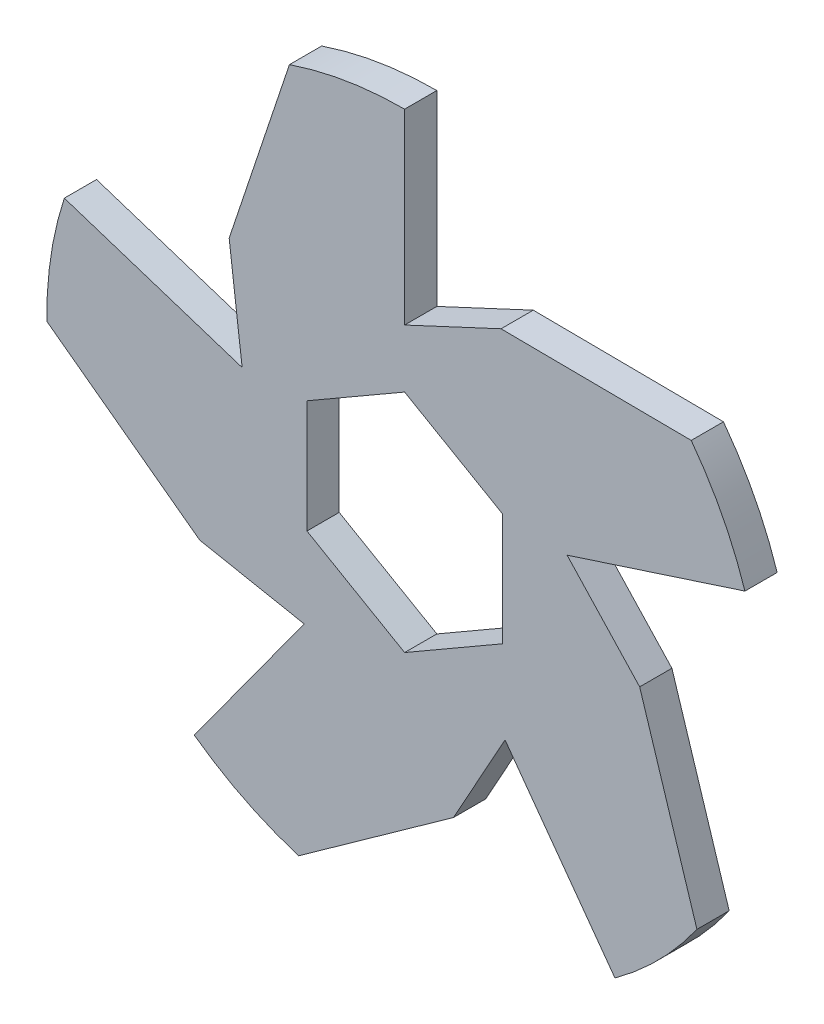
ISO-10303-21;
HEADER;
FILE_DESCRIPTION(('STEP AP214'),'2;1');
FILE_NAME('part.step','',(''),(''),'','','');
FILE_SCHEMA(('AUTOMOTIVE_DESIGN { 1 0 10303 214 1 1 1 1 }'));
ENDSEC;
DATA;
#1=APPLICATION_CONTEXT('core data for automotive mechanical design processes');
#2=APPLICATION_PROTOCOL_DEFINITION('international standard','automotive_design',2000,#1);
#3=PRODUCT_CONTEXT('',#1,'mechanical');
#4=PRODUCT('Part','Part','',(#3));
#5=PRODUCT_RELATED_PRODUCT_CATEGORY('part','',(#4));
#6=PRODUCT_DEFINITION_FORMATION('','',#4);
#7=PRODUCT_DEFINITION_CONTEXT('part definition',#1,'design');
#8=PRODUCT_DEFINITION('design','',#6,#7);
#9=PRODUCT_DEFINITION_SHAPE('','',#8);
#10=(LENGTH_UNIT() NAMED_UNIT(*) SI_UNIT(.MILLI.,.METRE.));
#11=(NAMED_UNIT(*) PLANE_ANGLE_UNIT() SI_UNIT($,.RADIAN.));
#12=(NAMED_UNIT(*) SI_UNIT($,.STERADIAN.) SOLID_ANGLE_UNIT());
#13=UNCERTAINTY_MEASURE_WITH_UNIT(LENGTH_MEASURE(1.E-05),#10,'distance_accuracy_value','');
#14=(GEOMETRIC_REPRESENTATION_CONTEXT(3) GLOBAL_UNCERTAINTY_ASSIGNED_CONTEXT((#13)) GLOBAL_UNIT_ASSIGNED_CONTEXT((#10,
#11,#12)) REPRESENTATION_CONTEXT('',''));
#15=CARTESIAN_POINT('',(0.,0.,0.));
#16=DIRECTION('',(0.,0.,1.));
#17=DIRECTION('',(1.,0.,0.));
#18=AXIS2_PLACEMENT_3D('',#15,#16,#17);
#19=CARTESIAN_POINT('',(0.,0.,5.));
#20=DIRECTION('',(0.309016994374945,-0.951056516295155,0.));
#21=DIRECTION('',(0.951056516295155,0.309016994374945,0.));
#22=AXIS2_PLACEMENT_3D('',#19,#20,#21);
#23=PLANE('',#22);
#24=DIRECTION('',(-0.951056516295154,-0.309016994374945,0.));
#25=VECTOR('',#24,1.);
#26=CARTESIAN_POINT('',(0.,0.,0.));
#27=LINE('',#26,#25);
#28=CARTESIAN_POINT('',(52.7836366543811,17.1504431878094,0.));
#29=VERTEX_POINT('',#28);
#30=CARTESIAN_POINT('',(25.2029976818216,8.18895035093603,0.));
#31=VERTEX_POINT('',#30);
#32=EDGE_CURVE('E264',#29,#31,#27,.T.);
#33=ORIENTED_EDGE('',*,*,#32,.F.);
#34=DIRECTION('',(0.,0.,-1.));
#35=VECTOR('',#34,1.);
#36=CARTESIAN_POINT('',(52.7836366543811,17.1504431878094,5.));
#37=LINE('',#36,#35);
#38=CARTESIAN_POINT('',(52.7836366543811,17.1504431878094,5.));
#39=VERTEX_POINT('',#38);
#40=EDGE_CURVE('E11',#39,#29,#37,.T.);
#41=ORIENTED_EDGE('',*,*,#40,.F.);
#42=DIRECTION('',(-0.951056516295154,-0.309016994374945,0.));
#43=VECTOR('',#42,1.);
#44=CARTESIAN_POINT('',(0.,0.,5.));
#45=LINE('',#44,#43);
#46=CARTESIAN_POINT('',(25.2029976818216,8.18895035093603,5.));
#47=VERTEX_POINT('',#46);
#48=EDGE_CURVE('E387',#39,#47,#45,.T.);
#49=ORIENTED_EDGE('',*,*,#48,.T.);
#50=DIRECTION('',(0.,0.,-1.));
#51=VECTOR('',#50,1.);
#52=CARTESIAN_POINT('',(25.2029976818216,8.18895035093603,5.));
#53=LINE('',#52,#51);
#54=EDGE_CURVE('E53',#47,#31,#53,.T.);
#55=ORIENTED_EDGE('',*,*,#54,.T.);
#56=EDGE_LOOP('',(#33,#41,#49,#55));
#57=FACE_BOUND('',#56,.T.);
#58=ADVANCED_FACE('F34',(#57),#23,.T.);
#59=CARTESIAN_POINT('',(0.,0.,5.));
#60=DIRECTION('',(0.,0.,-1.));
#61=DIRECTION('',(-1.,0.,0.));
#62=AXIS2_PLACEMENT_3D('',#59,#60,#61);
#63=CYLINDRICAL_SURFACE('',#62,55.5);
#64=CARTESIAN_POINT('',(0.,0.,0.));
#65=DIRECTION('',(0.,0.,1.));
#66=DIRECTION('',(1.,0.,0.));
#67=AXIS2_PLACEMENT_3D('',#64,#65,#66);
#68=CIRCLE('',#67,55.5);
#69=CARTESIAN_POINT('',(44.453068744138,33.2291239612021,0.));
#70=VERTEX_POINT('',#69);
#71=EDGE_CURVE('E266',#29,#70,#68,.T.);
#72=ORIENTED_EDGE('',*,*,#71,.T.);
#73=DIRECTION('',(0.,0.,-1.));
#74=VECTOR('',#73,1.);
#75=CARTESIAN_POINT('',(44.453068744138,33.2291239612021,5.));
#76=LINE('',#75,#74);
#77=CARTESIAN_POINT('',(44.453068744138,33.2291239612021,5.));
#78=VERTEX_POINT('',#77);
#79=EDGE_CURVE('E44',#78,#70,#76,.T.);
#80=ORIENTED_EDGE('',*,*,#79,.F.);
#81=CARTESIAN_POINT('',(0.,0.,5.));
#82=DIRECTION('',(0.,0.,1.));
#83=DIRECTION('',(1.,0.,0.));
#84=AXIS2_PLACEMENT_3D('',#81,#82,#83);
#85=CIRCLE('',#84,55.5);
#86=EDGE_CURVE('E228',#39,#78,#85,.T.);
#87=ORIENTED_EDGE('',*,*,#86,.F.);
#88=ORIENTED_EDGE('',*,*,#40,.T.);
#89=EDGE_LOOP('',(#72,#80,#87,#88));
#90=FACE_BOUND('',#89,.T.);
#91=ADVANCED_FACE('F485',(#90),#63,.T.);
#92=CARTESIAN_POINT('',(0.277965080714487,33.5946328303534,5.));
#93=DIRECTION('',(0.00827380872947419,0.999965771458758,0.));
#94=DIRECTION('',(-0.999965771458758,0.00827380872947419,0.));
#95=AXIS2_PLACEMENT_3D('',#92,#93,#94);
#96=PLANE('',#95);
#97=DIRECTION('',(0.999965771458758,-0.00827380872947419,0.));
#98=VECTOR('',#97,1.);
#99=CARTESIAN_POINT('',(0.277965080714487,33.5946328303534,0.));
#100=LINE('',#99,#98);
#101=CARTESIAN_POINT('',(14.9540784861047,33.4732013187216,0.));
#102=VERTEX_POINT('',#101);
#103=EDGE_CURVE('E269',#102,#70,#100,.T.);
#104=ORIENTED_EDGE('',*,*,#103,.F.);
#105=DIRECTION('',(0.,0.,-1.));
#106=VECTOR('',#105,1.);
#107=CARTESIAN_POINT('',(14.9540784861047,33.4732013187216,5.));
#108=LINE('',#107,#106);
#109=CARTESIAN_POINT('',(14.9540784861047,33.4732013187216,5.));
#110=VERTEX_POINT('',#109);
#111=EDGE_CURVE('E343',#110,#102,#108,.T.);
#112=ORIENTED_EDGE('',*,*,#111,.F.);
#113=DIRECTION('',(0.999965771458758,-0.00827380872947419,0.));
#114=VECTOR('',#113,1.);
#115=CARTESIAN_POINT('',(0.277965080714487,33.5946328303534,5.));
#116=LINE('',#115,#114);
#117=EDGE_CURVE('E389',#110,#78,#116,.T.);
#118=ORIENTED_EDGE('',*,*,#117,.T.);
#119=ORIENTED_EDGE('',*,*,#79,.T.);
#120=EDGE_LOOP('',(#104,#112,#118,#119));
#121=FACE_BOUND('',#120,.T.);
#122=ADVANCED_FACE('F490',(#121),#96,.T.);
#123=CARTESIAN_POINT('',(-10.1500888713265,21.7669358283465,5.));
#124=DIRECTION('',(-0.422618261740704,0.906307787036648,0.));
#125=DIRECTION('',(-0.906307787036648,-0.422618261740704,0.));
#126=AXIS2_PLACEMENT_3D('',#123,#124,#125);
#127=PLANE('',#126);
#128=DIRECTION('',(0.906307787036648,0.422618261740704,0.));
#129=VECTOR('',#128,1.);
#130=CARTESIAN_POINT('',(-10.1500888713265,21.7669358283465,0.));
#131=LINE('',#130,#129);
#132=CARTESIAN_POINT('',(0.,26.5,0.));
#133=VERTEX_POINT('',#132);
#134=EDGE_CURVE('E273',#133,#102,#131,.T.);
#135=ORIENTED_EDGE('',*,*,#134,.F.);
#136=DIRECTION('',(0.,0.,-1.));
#137=VECTOR('',#136,1.);
#138=CARTESIAN_POINT('',(0.,26.5,5.));
#139=LINE('',#138,#137);
#140=CARTESIAN_POINT('',(0.,26.5,5.));
#141=VERTEX_POINT('',#140);
#142=EDGE_CURVE('E341',#141,#133,#139,.T.);
#143=ORIENTED_EDGE('',*,*,#142,.F.);
#144=DIRECTION('',(0.906307787036648,0.422618261740704,0.));
#145=VECTOR('',#144,1.);
#146=CARTESIAN_POINT('',(-10.1500888713265,21.7669358283465,5.));
#147=LINE('',#146,#145);
#148=EDGE_CURVE('E393',#141,#110,#147,.T.);
#149=ORIENTED_EDGE('',*,*,#148,.T.);
#150=ORIENTED_EDGE('',*,*,#111,.T.);
#151=EDGE_LOOP('',(#135,#143,#149,#150));
#152=FACE_BOUND('',#151,.T.);
#153=ADVANCED_FACE('F682',(#152),#127,.T.);
#154=CARTESIAN_POINT('',(0.,0.,5.));
#155=DIRECTION('',(1.,0.,0.));
#156=DIRECTION('',(0.,1.,0.));
#157=AXIS2_PLACEMENT_3D('',#154,#155,#156);
#158=PLANE('',#157);
#159=DIRECTION('',(0.,-1.,0.));
#160=VECTOR('',#159,1.);
#161=CARTESIAN_POINT('',(0.,0.,0.));
#162=LINE('',#161,#160);
#163=CARTESIAN_POINT('',(0.,55.5,0.));
#164=VERTEX_POINT('',#163);
#165=EDGE_CURVE('E276',#164,#133,#162,.T.);
#166=ORIENTED_EDGE('',*,*,#165,.F.);
#167=DIRECTION('',(0.,0.,-1.));
#168=VECTOR('',#167,1.);
#169=CARTESIAN_POINT('',(0.,55.5,5.));
#170=LINE('',#169,#168);
#171=CARTESIAN_POINT('',(0.,55.5,5.));
#172=VERTEX_POINT('',#171);
#173=EDGE_CURVE('E339',#172,#164,#170,.T.);
#174=ORIENTED_EDGE('',*,*,#173,.F.);
#175=DIRECTION('',(0.,-1.,0.));
#176=VECTOR('',#175,1.);
#177=CARTESIAN_POINT('',(0.,0.,5.));
#178=LINE('',#177,#176);
#179=EDGE_CURVE('E396',#172,#141,#178,.T.);
#180=ORIENTED_EDGE('',*,*,#179,.T.);
#181=ORIENTED_EDGE('',*,*,#142,.T.);
#182=EDGE_LOOP('',(#166,#174,#180,#181));
#183=FACE_BOUND('',#182,.T.);
#184=ADVANCED_FACE('F673',(#183),#158,.T.);
#185=CARTESIAN_POINT('',(-17.8660211800237,52.5457447106323,0.));
#186=VERTEX_POINT('',#185);
#187=EDGE_CURVE('E270',#164,#186,#68,.T.);
#188=ORIENTED_EDGE('',*,*,#187,.T.);
#189=DIRECTION('',(0.,0.,-1.));
#190=VECTOR('',#189,1.);
#191=CARTESIAN_POINT('',(-17.8660211800237,52.5457447106323,5.));
#192=LINE('',#191,#190);
#193=CARTESIAN_POINT('',(-17.8660211800237,52.5457447106323,5.));
#194=VERTEX_POINT('',#193);
#195=EDGE_CURVE('E337',#194,#186,#192,.T.);
#196=ORIENTED_EDGE('',*,*,#195,.F.);
#197=EDGE_CURVE('E390',#172,#194,#85,.T.);
#198=ORIENTED_EDGE('',*,*,#197,.F.);
#199=ORIENTED_EDGE('',*,*,#173,.T.);
#200=EDGE_LOOP('',(#188,#196,#198,#199));
#201=FACE_BOUND('',#200,.T.);
#202=ADVANCED_FACE('F439',(#201),#63,.T.);
#203=CARTESIAN_POINT('',(-31.864498532067,10.6456729656821,5.));
#204=DIRECTION('',(-0.948467215512343,0.316875276880768,0.));
#205=DIRECTION('',(-0.316875276880768,-0.948467215512343,0.));
#206=AXIS2_PLACEMENT_3D('',#203,#204,#205);
#207=PLANE('',#206);
#208=DIRECTION('',(0.316875276880768,0.948467215512343,0.));
#209=VECTOR('',#208,1.);
#210=CARTESIAN_POINT('',(-31.864498532067,10.6456729656821,0.));
#211=LINE('',#210,#209);
#212=CARTESIAN_POINT('',(-27.2138418480063,24.5659618530182,0.));
#213=VERTEX_POINT('',#212);
#214=EDGE_CURVE('E279',#213,#186,#211,.T.);
#215=ORIENTED_EDGE('',*,*,#214,.F.);
#216=DIRECTION('',(0.,0.,-1.));
#217=VECTOR('',#216,1.);
#218=CARTESIAN_POINT('',(-27.2138418480063,24.5659618530182,5.));
#219=LINE('',#218,#217);
#220=CARTESIAN_POINT('',(-27.2138418480063,24.5659618530182,5.));
#221=VERTEX_POINT('',#220);
#222=EDGE_CURVE('E335',#221,#213,#219,.T.);
#223=ORIENTED_EDGE('',*,*,#222,.F.);
#224=DIRECTION('',(0.316875276880768,0.948467215512343,0.));
#225=VECTOR('',#224,1.);
#226=CARTESIAN_POINT('',(-31.864498532067,10.6456729656821,5.));
#227=LINE('',#226,#225);
#228=EDGE_CURVE('E399',#221,#194,#227,.T.);
#229=ORIENTED_EDGE('',*,*,#228,.T.);
#230=ORIENTED_EDGE('',*,*,#195,.T.);
#231=EDGE_LOOP('',(#215,#223,#229,#230));
#232=FACE_BOUND('',#231,.T.);
#233=ADVANCED_FACE('F445',(#232),#207,.T.);
#234=CARTESIAN_POINT('',(-23.8381361149834,-2.92695507562176,5.));
#235=DIRECTION('',(-0.992546151641323,-0.121869343405142,0.));
#236=DIRECTION('',(0.121869343405142,-0.992546151641323,0.));
#237=AXIS2_PLACEMENT_3D('',#234,#235,#236);
#238=PLANE('',#237);
#239=DIRECTION('',(-0.121869343405142,0.992546151641323,0.));
#240=VECTOR('',#239,1.);
#241=CARTESIAN_POINT('',(-23.8381361149834,-2.92695507562176,0.));
#242=LINE('',#241,#240);
#243=CARTESIAN_POINT('',(-25.2029976818215,8.1889503509364,0.));
#244=VERTEX_POINT('',#243);
#245=EDGE_CURVE('E282',#244,#213,#242,.T.);
#246=ORIENTED_EDGE('',*,*,#245,.F.);
#247=DIRECTION('',(0.,0.,-1.));
#248=VECTOR('',#247,1.);
#249=CARTESIAN_POINT('',(-25.2029976818215,8.1889503509364,5.));
#250=LINE('',#249,#248);
#251=CARTESIAN_POINT('',(-25.2029976818215,8.1889503509364,5.));
#252=VERTEX_POINT('',#251);
#253=EDGE_CURVE('E333',#252,#244,#250,.T.);
#254=ORIENTED_EDGE('',*,*,#253,.F.);
#255=DIRECTION('',(-0.121869343405142,0.992546151641323,0.));
#256=VECTOR('',#255,1.);
#257=CARTESIAN_POINT('',(-23.8381361149834,-2.92695507562176,5.));
#258=LINE('',#257,#256);
#259=EDGE_CURVE('E402',#252,#221,#258,.T.);
#260=ORIENTED_EDGE('',*,*,#259,.T.);
#261=ORIENTED_EDGE('',*,*,#222,.T.);
#262=EDGE_LOOP('',(#246,#254,#260,#261));
#263=FACE_BOUND('',#262,.T.);
#264=ADVANCED_FACE('F451',(#263),#238,.T.);
#265=CARTESIAN_POINT('',(0.,0.,5.));
#266=DIRECTION('',(0.309016994374958,0.95105651629515,0.));
#267=DIRECTION('',(-0.95105651629515,0.309016994374958,0.));
#268=AXIS2_PLACEMENT_3D('',#265,#266,#267);
#269=PLANE('',#268);
#270=DIRECTION('',(0.95105651629515,-0.309016994374958,0.));
#271=VECTOR('',#270,1.);
#272=CARTESIAN_POINT('',(0.,0.,0.));
#273=LINE('',#272,#271);
#274=CARTESIAN_POINT('',(-52.7836366543808,17.1504431878102,0.));
#275=VERTEX_POINT('',#274);
#276=EDGE_CURVE('E285',#275,#244,#273,.T.);
#277=ORIENTED_EDGE('',*,*,#276,.F.);
#278=DIRECTION('',(0.,0.,-1.));
#279=VECTOR('',#278,1.);
#280=CARTESIAN_POINT('',(-52.7836366543808,17.1504431878102,5.));
#281=LINE('',#280,#279);
#282=CARTESIAN_POINT('',(-52.7836366543808,17.1504431878102,5.));
#283=VERTEX_POINT('',#282);
#284=EDGE_CURVE('E331',#283,#275,#281,.T.);
#285=ORIENTED_EDGE('',*,*,#284,.F.);
#286=DIRECTION('',(0.95105651629515,-0.309016994374958,0.));
#287=VECTOR('',#286,1.);
#288=CARTESIAN_POINT('',(0.,0.,5.));
#289=LINE('',#288,#287);
#290=EDGE_CURVE('E405',#283,#252,#289,.T.);
#291=ORIENTED_EDGE('',*,*,#290,.T.);
#292=ORIENTED_EDGE('',*,*,#253,.T.);
#293=EDGE_LOOP('',(#277,#285,#291,#292));
#294=FACE_BOUND('',#293,.T.);
#295=ADVANCED_FACE('F454',(#294),#269,.T.);
#296=CARTESIAN_POINT('',(-55.4948770771185,-0.75406776585598,0.));
#297=VERTEX_POINT('',#296);
#298=EDGE_CURVE('E288',#275,#297,#68,.T.);
#299=ORIENTED_EDGE('',*,*,#298,.T.);
#300=DIRECTION('',(0.,0.,-1.));
#301=VECTOR('',#300,1.);
#302=CARTESIAN_POINT('',(-55.4948770771185,-0.75406776585598,5.));
#303=LINE('',#302,#301);
#304=CARTESIAN_POINT('',(-55.4948770771185,-0.75406776585598,5.));
#305=VERTEX_POINT('',#304);
#306=EDGE_CURVE('E329',#305,#297,#303,.T.);
#307=ORIENTED_EDGE('',*,*,#306,.F.);
#308=EDGE_CURVE('E408',#283,#305,#85,.T.);
#309=ORIENTED_EDGE('',*,*,#308,.F.);
#310=ORIENTED_EDGE('',*,*,#284,.T.);
#311=EDGE_LOOP('',(#299,#307,#309,#310));
#312=FACE_BOUND('',#311,.T.);
#313=ADVANCED_FACE('F458',(#312),#63,.T.);
#314=CARTESIAN_POINT('',(-19.9713082080033,-27.015245104446,5.));
#315=DIRECTION('',(-0.594458785131083,-0.804126080151911,0.));
#316=DIRECTION('',(0.804126080151911,-0.594458785131083,0.));
#317=AXIS2_PLACEMENT_3D('',#314,#315,#316);
#318=PLANE('',#317);
#319=DIRECTION('',(-0.804126080151911,0.594458785131083,0.));
#320=VECTOR('',#319,1.);
#321=CARTESIAN_POINT('',(-19.9713082080033,-27.015245104446,0.));
#322=LINE('',#321,#320);
#323=CARTESIAN_POINT('',(-31.7731577126372,-18.2906019272229,0.));
#324=VERTEX_POINT('',#323);
#325=EDGE_CURVE('E289',#324,#297,#322,.T.);
#326=ORIENTED_EDGE('',*,*,#325,.F.);
#327=DIRECTION('',(0.,0.,-1.));
#328=VECTOR('',#327,1.);
#329=CARTESIAN_POINT('',(-31.7731577126372,-18.2906019272229,5.));
#330=LINE('',#329,#328);
#331=CARTESIAN_POINT('',(-31.7731577126372,-18.2906019272229,5.));
#332=VERTEX_POINT('',#331);
#333=EDGE_CURVE('E327',#332,#324,#330,.T.);
#334=ORIENTED_EDGE('',*,*,#333,.F.);
#335=DIRECTION('',(-0.804126080151911,0.594458785131083,0.));
#336=VECTOR('',#335,1.);
#337=CARTESIAN_POINT('',(-19.9713082080033,-27.015245104446,5.));
#338=LINE('',#337,#336);
#339=EDGE_CURVE('E409',#332,#305,#338,.T.);
#340=ORIENTED_EDGE('',*,*,#339,.T.);
#341=ORIENTED_EDGE('',*,*,#306,.T.);
#342=EDGE_LOOP('',(#326,#334,#340,#341));
#343=FACE_BOUND('',#342,.T.);
#344=ADVANCED_FACE('F461',(#343),#318,.T.);
#345=CARTESIAN_POINT('',(-4.58268947617975,-23.5758935486249,5.));
#346=DIRECTION('',(-0.190808995376549,-0.981627183447663,0.));
#347=DIRECTION('',(0.981627183447663,-0.190808995376549,0.));
#348=AXIS2_PLACEMENT_3D('',#345,#346,#347);
#349=PLANE('',#348);
#350=DIRECTION('',(-0.981627183447663,0.190808995376549,0.));
#351=VECTOR('',#350,1.);
#352=CARTESIAN_POINT('',(-4.58268947617975,-23.5758935486249,0.));
#353=LINE('',#352,#351);
#354=CARTESIAN_POINT('',(-15.5763091857507,-21.438950350936,0.));
#355=VERTEX_POINT('',#354);
#356=EDGE_CURVE('E292',#355,#324,#353,.T.);
#357=ORIENTED_EDGE('',*,*,#356,.F.);
#358=DIRECTION('',(0.,0.,-1.));
#359=VECTOR('',#358,1.);
#360=CARTESIAN_POINT('',(-15.5763091857507,-21.438950350936,5.));
#361=LINE('',#360,#359);
#362=CARTESIAN_POINT('',(-15.5763091857507,-21.438950350936,5.));
#363=VERTEX_POINT('',#362);
#364=EDGE_CURVE('E325',#363,#355,#361,.T.);
#365=ORIENTED_EDGE('',*,*,#364,.F.);
#366=DIRECTION('',(-0.981627183447663,0.190808995376549,0.));
#367=VECTOR('',#366,1.);
#368=CARTESIAN_POINT('',(-4.58268947617975,-23.5758935486249,5.));
#369=LINE('',#368,#367);
#370=EDGE_CURVE('E412',#363,#332,#369,.T.);
#371=ORIENTED_EDGE('',*,*,#370,.T.);
#372=ORIENTED_EDGE('',*,*,#333,.T.);
#373=EDGE_LOOP('',(#357,#365,#371,#372));
#374=FACE_BOUND('',#373,.T.);
#375=ADVANCED_FACE('F464',(#374),#349,.T.);
#376=CARTESIAN_POINT('',(0.,0.,5.));
#377=DIRECTION('',(-0.809016994374942,0.58778525229248,0.));
#378=DIRECTION('',(-0.58778525229248,-0.809016994374942,0.));
#379=AXIS2_PLACEMENT_3D('',#376,#377,#378);
#380=PLANE('',#379);
#381=DIRECTION('',(0.58778525229248,0.809016994374942,0.));
#382=VECTOR('',#381,1.);
#383=CARTESIAN_POINT('',(0.,0.,0.));
#384=LINE('',#383,#382);
#385=CARTESIAN_POINT('',(-32.6220815022327,-44.9004431878093,0.));
#386=VERTEX_POINT('',#385);
#387=EDGE_CURVE('E295',#386,#355,#384,.T.);
#388=ORIENTED_EDGE('',*,*,#387,.F.);
#389=DIRECTION('',(0.,0.,-1.));
#390=VECTOR('',#389,1.);
#391=CARTESIAN_POINT('',(-32.6220815022327,-44.9004431878093,5.));
#392=LINE('',#391,#390);
#393=CARTESIAN_POINT('',(-32.6220815022327,-44.9004431878093,5.));
#394=VERTEX_POINT('',#393);
#395=EDGE_CURVE('E323',#394,#386,#392,.T.);
#396=ORIENTED_EDGE('',*,*,#395,.F.);
#397=DIRECTION('',(0.58778525229248,0.809016994374942,0.));
#398=VECTOR('',#397,1.);
#399=CARTESIAN_POINT('',(0.,0.,5.));
#400=LINE('',#399,#398);
#401=EDGE_CURVE('E415',#394,#363,#400,.T.);
#402=ORIENTED_EDGE('',*,*,#401,.T.);
#403=ORIENTED_EDGE('',*,*,#364,.T.);
#404=EDGE_LOOP('',(#388,#396,#402,#403));
#405=FACE_BOUND('',#404,.T.);
#406=ADVANCED_FACE('F468',(#405),#380,.T.);
#407=CARTESIAN_POINT('',(-16.4316990551327,-53.011784219752,0.));
#408=VERTEX_POINT('',#407);
#409=EDGE_CURVE('E298',#386,#408,#68,.T.);
#410=ORIENTED_EDGE('',*,*,#409,.T.);
#411=DIRECTION('',(0.,0.,-1.));
#412=VECTOR('',#411,1.);
#413=CARTESIAN_POINT('',(-16.4316990551327,-53.011784219752,5.));
#414=LINE('',#413,#412);
#415=CARTESIAN_POINT('',(-16.4316990551327,-53.011784219752,5.));
#416=VERTEX_POINT('',#415);
#417=EDGE_CURVE('E321',#416,#408,#414,.T.);
#418=ORIENTED_EDGE('',*,*,#417,.F.);
#419=EDGE_CURVE('E227',#394,#416,#85,.T.);
#420=ORIENTED_EDGE('',*,*,#419,.F.);
#421=ORIENTED_EDGE('',*,*,#395,.T.);
#422=EDGE_LOOP('',(#410,#418,#420,#421));
#423=FACE_BOUND('',#422,.T.);
#424=ADVANCED_FACE('F470',(#423),#63,.T.);
#425=CARTESIAN_POINT('',(19.5215512597213,-27.3420126546388,5.));
#426=DIRECTION('',(0.581071481390366,-0.813852525654867,0.));
#427=DIRECTION('',(0.813852525654867,0.581071481390366,0.));
#428=AXIS2_PLACEMENT_3D('',#425,#426,#427);
#429=PLANE('',#428);
#430=DIRECTION('',(-0.813852525654867,-0.581071481390366,0.));
#431=VECTOR('',#430,1.);
#432=CARTESIAN_POINT('',(19.5215512597213,-27.3420126546388,0.));
#433=LINE('',#432,#431);
#434=CARTESIAN_POINT('',(7.57695045168584,-35.8701755187362,0.));
#435=VERTEX_POINT('',#434);
#436=EDGE_CURVE('E299',#435,#408,#433,.T.);
#437=ORIENTED_EDGE('',*,*,#436,.F.);
#438=DIRECTION('',(0.,0.,-1.));
#439=VECTOR('',#438,1.);
#440=CARTESIAN_POINT('',(7.57695045168584,-35.8701755187362,5.));
#441=LINE('',#440,#439);
#442=CARTESIAN_POINT('',(7.57695045168584,-35.8701755187362,5.));
#443=VERTEX_POINT('',#442);
#444=EDGE_CURVE('E319',#443,#435,#441,.T.);
#445=ORIENTED_EDGE('',*,*,#444,.F.);
#446=DIRECTION('',(-0.813852525654867,-0.581071481390366,0.));
#447=VECTOR('',#446,1.);
#448=CARTESIAN_POINT('',(19.5215512597213,-27.3420126546388,5.));
#449=LINE('',#448,#447);
#450=EDGE_CURVE('E418',#443,#416,#449,.T.);
#451=ORIENTED_EDGE('',*,*,#450,.T.);
#452=ORIENTED_EDGE('',*,*,#417,.T.);
#453=EDGE_LOOP('',(#437,#445,#451,#452));
#454=FACE_BOUND('',#453,.T.);
#455=ADVANCED_FACE('F474',(#454),#429,.T.);
#456=CARTESIAN_POINT('',(21.0058782588179,-11.6437484525777,5.));
#457=DIRECTION('',(0.874619707139396,-0.484809620246338,0.));
#458=DIRECTION('',(0.484809620246338,0.874619707139396,0.));
#459=AXIS2_PLACEMENT_3D('',#456,#457,#458);
#460=PLANE('',#459);
#461=DIRECTION('',(-0.484809620246338,-0.874619707139396,0.));
#462=VECTOR('',#461,1.);
#463=CARTESIAN_POINT('',(21.0058782588179,-11.6437484525777,0.));
#464=LINE('',#463,#462);
#465=CARTESIAN_POINT('',(15.5763091857504,-21.4389503509362,0.));
#466=VERTEX_POINT('',#465);
#467=EDGE_CURVE('E302',#466,#435,#464,.T.);
#468=ORIENTED_EDGE('',*,*,#467,.F.);
#469=DIRECTION('',(0.,0.,-1.));
#470=VECTOR('',#469,1.);
#471=CARTESIAN_POINT('',(15.5763091857504,-21.4389503509362,5.));
#472=LINE('',#471,#470);
#473=CARTESIAN_POINT('',(15.5763091857504,-21.4389503509362,5.));
#474=VERTEX_POINT('',#473);
#475=EDGE_CURVE('E317',#474,#466,#472,.T.);
#476=ORIENTED_EDGE('',*,*,#475,.F.);
#477=DIRECTION('',(-0.484809620246338,-0.874619707139396,0.));
#478=VECTOR('',#477,1.);
#479=CARTESIAN_POINT('',(21.0058782588179,-11.6437484525777,5.));
#480=LINE('',#479,#478);
#481=EDGE_CURVE('E420',#474,#443,#480,.T.);
#482=ORIENTED_EDGE('',*,*,#481,.T.);
#483=ORIENTED_EDGE('',*,*,#444,.T.);
#484=EDGE_LOOP('',(#468,#476,#482,#483));
#485=FACE_BOUND('',#484,.T.);
#486=ADVANCED_FACE('F475',(#485),#460,.T.);
#487=CARTESIAN_POINT('',(0.,0.,5.));
#488=DIRECTION('',(-0.809016994374951,-0.587785252292469,0.));
#489=DIRECTION('',(0.587785252292469,-0.809016994374951,0.));
#490=AXIS2_PLACEMENT_3D('',#487,#488,#489);
#491=PLANE('',#490);
#492=DIRECTION('',(-0.587785252292469,0.809016994374951,0.));
#493=VECTOR('',#492,1.);
#494=CARTESIAN_POINT('',(0.,0.,0.));
#495=LINE('',#494,#493);
#496=CARTESIAN_POINT('',(32.622081502232,-44.9004431878098,0.));
#497=VERTEX_POINT('',#496);
#498=EDGE_CURVE('E305',#497,#466,#495,.T.);
#499=ORIENTED_EDGE('',*,*,#498,.F.);
#500=DIRECTION('',(0.,0.,-1.));
#501=VECTOR('',#500,1.);
#502=CARTESIAN_POINT('',(32.622081502232,-44.9004431878098,5.));
#503=LINE('',#502,#501);
#504=CARTESIAN_POINT('',(32.622081502232,-44.9004431878098,5.));
#505=VERTEX_POINT('',#504);
#506=EDGE_CURVE('E236',#505,#497,#503,.T.);
#507=ORIENTED_EDGE('',*,*,#506,.F.);
#508=DIRECTION('',(-0.587785252292469,0.809016994374951,0.));
#509=VECTOR('',#508,1.);
#510=CARTESIAN_POINT('',(0.,0.,5.));
#511=LINE('',#510,#509);
#512=EDGE_CURVE('E224',#505,#474,#511,.T.);
#513=ORIENTED_EDGE('',*,*,#512,.T.);
#514=ORIENTED_EDGE('',*,*,#475,.T.);
#515=EDGE_LOOP('',(#499,#507,#513,#514));
#516=FACE_BOUND('',#515,.T.);
#517=ADVANCED_FACE('F425',(#516),#491,.T.);
#518=CARTESIAN_POINT('',(45.3395285681371,-32.0090166862258,0.));
#519=VERTEX_POINT('',#518);
#520=EDGE_CURVE('E233',#497,#519,#68,.T.);
#521=ORIENTED_EDGE('',*,*,#520,.T.);
#522=DIRECTION('',(0.,0.,-1.));
#523=VECTOR('',#522,1.);
#524=CARTESIAN_POINT('',(45.3395285681371,-32.0090166862258,5.));
#525=LINE('',#524,#523);
#526=CARTESIAN_POINT('',(45.3395285681371,-32.0090166862258,5.));
#527=VERTEX_POINT('',#526);
#528=EDGE_CURVE('E230',#527,#519,#525,.T.);
#529=ORIENTED_EDGE('',*,*,#528,.F.);
#530=EDGE_CURVE('E215',#505,#527,#85,.T.);
#531=ORIENTED_EDGE('',*,*,#530,.F.);
#532=ORIENTED_EDGE('',*,*,#506,.T.);
#533=EDGE_LOOP('',(#521,#529,#531,#532));
#534=FACE_BOUND('',#533,.T.);
#535=ADVANCED_FACE('F231',(#534),#63,.T.);
#536=CARTESIAN_POINT('',(32.0362903996343,10.1169519630496,5.));
#537=DIRECTION('',(0.953580710523578,0.301137557467262,0.));
#538=DIRECTION('',(-0.301137557467262,0.953580710523578,0.));
#539=AXIS2_PLACEMENT_3D('',#536,#537,#538);
#540=PLANE('',#539);
#541=DIRECTION('',(0.301137557467262,-0.953580710523578,0.));
#542=VECTOR('',#541,1.);
#543=CARTESIAN_POINT('',(32.0362903996343,10.1169519630496,0.));
#544=LINE('',#543,#542);
#545=CARTESIAN_POINT('',(36.4559706228529,-3.87838572578026,0.));
#546=VERTEX_POINT('',#545);
#547=EDGE_CURVE('E308',#546,#519,#544,.T.);
#548=ORIENTED_EDGE('',*,*,#547,.F.);
#549=DIRECTION('',(0.,0.,-1.));
#550=VECTOR('',#549,1.);
#551=CARTESIAN_POINT('',(36.4559706228529,-3.87838572578026,5.));
#552=LINE('',#551,#550);
#553=CARTESIAN_POINT('',(36.4559706228529,-3.87838572578026,5.));
#554=VERTEX_POINT('',#553);
#555=EDGE_CURVE('E132',#554,#546,#552,.T.);
#556=ORIENTED_EDGE('',*,*,#555,.F.);
#557=DIRECTION('',(0.301137557467262,-0.953580710523578,0.));
#558=VECTOR('',#557,1.);
#559=CARTESIAN_POINT('',(32.0362903996343,10.1169519630496,5.));
#560=LINE('',#559,#558);
#561=EDGE_CURVE('E221',#554,#527,#560,.T.);
#562=ORIENTED_EDGE('',*,*,#561,.T.);
#563=ORIENTED_EDGE('',*,*,#528,.T.);
#564=EDGE_LOOP('',(#548,#556,#562,#563));
#565=FACE_BOUND('',#564,.T.);
#566=ADVANCED_FACE('F238',(#565),#540,.T.);
#567=CARTESIAN_POINT('',(7.57500000000001,13.1202848673342,5.));
#568=DIRECTION('',(-0.5,-0.866025403784438,0.));
#569=DIRECTION('',(0.866025403784439,-0.5,0.));
#570=AXIS2_PLACEMENT_3D('',#567,#568,#569);
#571=PLANE('',#570);
#572=DIRECTION('',(-0.866025403784439,0.5,0.));
#573=VECTOR('',#572,1.);
#574=CARTESIAN_POINT('',(7.57500000000001,13.1202848673342,0.));
#575=LINE('',#574,#573);
#576=CARTESIAN_POINT('',(15.15,8.74685657822283,0.));
#577=VERTEX_POINT('',#576);
#578=CARTESIAN_POINT('',(0.,17.4937131564457,0.));
#579=VERTEX_POINT('',#578);
#580=EDGE_CURVE('E246',#577,#579,#575,.T.);
#581=ORIENTED_EDGE('',*,*,#580,.F.);
#582=DIRECTION('',(0.,0.,-1.));
#583=VECTOR('',#582,1.);
#584=CARTESIAN_POINT('',(15.15,8.74685657822283,5.));
#585=LINE('',#584,#583);
#586=CARTESIAN_POINT('',(15.15,8.74685657822283,5.));
#587=VERTEX_POINT('',#586);
#588=EDGE_CURVE('E38',#587,#577,#585,.T.);
#589=ORIENTED_EDGE('',*,*,#588,.F.);
#590=DIRECTION('',(-0.866025403784439,0.5,0.));
#591=VECTOR('',#590,1.);
#592=CARTESIAN_POINT('',(7.57500000000001,13.1202848673342,5.));
#593=LINE('',#592,#591);
#594=CARTESIAN_POINT('',(0.,17.4937131564457,5.));
#595=VERTEX_POINT('',#594);
#596=EDGE_CURVE('E313',#587,#595,#593,.T.);
#597=ORIENTED_EDGE('',*,*,#596,.T.);
#598=DIRECTION('',(0.,0.,-1.));
#599=VECTOR('',#598,1.);
#600=CARTESIAN_POINT('',(0.,17.4937131564457,5.));
#601=LINE('',#600,#599);
#602=EDGE_CURVE('E241',#595,#579,#601,.T.);
#603=ORIENTED_EDGE('',*,*,#602,.T.);
#604=EDGE_LOOP('',(#581,#589,#597,#603));
#605=FACE_BOUND('',#604,.T.);
#606=ADVANCED_FACE('F36',(#605),#571,.T.);
#607=CARTESIAN_POINT('',(15.15,0.,5.));
#608=DIRECTION('',(-1.,0.,0.));
#609=DIRECTION('',(0.,0.,1.));
#610=AXIS2_PLACEMENT_3D('',#607,#608,#609);
#611=PLANE('',#610);
#612=DIRECTION('',(0.,1.,0.));
#613=VECTOR('',#612,1.);
#614=CARTESIAN_POINT('',(15.15,0.,0.));
#615=LINE('',#614,#613);
#616=CARTESIAN_POINT('',(15.15,-8.74685657822283,0.));
#617=VERTEX_POINT('',#616);
#618=EDGE_CURVE('E249',#617,#577,#615,.T.);
#619=ORIENTED_EDGE('',*,*,#618,.F.);
#620=DIRECTION('',(0.,0.,-1.));
#621=VECTOR('',#620,1.);
#622=CARTESIAN_POINT('',(15.15,-8.74685657822283,5.));
#623=LINE('',#622,#621);
#624=CARTESIAN_POINT('',(15.15,-8.74685657822283,5.));
#625=VERTEX_POINT('',#624);
#626=EDGE_CURVE('E352',#625,#617,#623,.T.);
#627=ORIENTED_EDGE('',*,*,#626,.F.);
#628=DIRECTION('',(0.,1.,0.));
#629=VECTOR('',#628,1.);
#630=CARTESIAN_POINT('',(15.15,0.,5.));
#631=LINE('',#630,#629);
#632=EDGE_CURVE('E361',#625,#587,#631,.T.);
#633=ORIENTED_EDGE('',*,*,#632,.T.);
#634=ORIENTED_EDGE('',*,*,#588,.T.);
#635=EDGE_LOOP('',(#619,#627,#633,#634));
#636=FACE_BOUND('',#635,.T.);
#637=ADVANCED_FACE('F359',(#636),#611,.T.);
#638=CARTESIAN_POINT('',(7.575,-13.1202848673343,5.));
#639=DIRECTION('',(-0.5,0.866025403784439,0.));
#640=DIRECTION('',(-0.866025403784439,-0.5,0.));
#641=AXIS2_PLACEMENT_3D('',#638,#639,#640);
#642=PLANE('',#641);
#643=DIRECTION('',(0.866025403784439,0.5,0.));
#644=VECTOR('',#643,1.);
#645=CARTESIAN_POINT('',(7.575,-13.1202848673343,0.));
#646=LINE('',#645,#644);
#647=CARTESIAN_POINT('',(0.,-17.4937131564457,0.));
#648=VERTEX_POINT('',#647);
#649=EDGE_CURVE('E252',#648,#617,#646,.T.);
#650=ORIENTED_EDGE('',*,*,#649,.F.);
#651=DIRECTION('',(0.,0.,-1.));
#652=VECTOR('',#651,1.);
#653=CARTESIAN_POINT('',(0.,-17.4937131564457,5.));
#654=LINE('',#653,#652);
#655=CARTESIAN_POINT('',(0.,-17.4937131564457,5.));
#656=VERTEX_POINT('',#655);
#657=EDGE_CURVE('E351',#656,#648,#654,.T.);
#658=ORIENTED_EDGE('',*,*,#657,.F.);
#659=DIRECTION('',(0.866025403784439,0.5,0.));
#660=VECTOR('',#659,1.);
#661=CARTESIAN_POINT('',(7.575,-13.1202848673343,5.));
#662=LINE('',#661,#660);
#663=EDGE_CURVE('E369',#656,#625,#662,.T.);
#664=ORIENTED_EDGE('',*,*,#663,.T.);
#665=ORIENTED_EDGE('',*,*,#626,.T.);
#666=EDGE_LOOP('',(#650,#658,#664,#665));
#667=FACE_BOUND('',#666,.T.);
#668=ADVANCED_FACE('F367',(#667),#642,.T.);
#669=CARTESIAN_POINT('',(-7.575,-13.1202848673342,5.));
#670=DIRECTION('',(0.5,0.866025403784439,0.));
#671=DIRECTION('',(-0.866025403784439,0.5,0.));
#672=AXIS2_PLACEMENT_3D('',#669,#670,#671);
#673=PLANE('',#672);
#674=DIRECTION('',(0.866025403784439,-0.5,0.));
#675=VECTOR('',#674,1.);
#676=CARTESIAN_POINT('',(-7.575,-13.1202848673342,0.));
#677=LINE('',#676,#675);
#678=CARTESIAN_POINT('',(-15.15,-8.74685657822283,0.));
#679=VERTEX_POINT('',#678);
#680=EDGE_CURVE('E255',#679,#648,#677,.T.);
#681=ORIENTED_EDGE('',*,*,#680,.F.);
#682=DIRECTION('',(0.,0.,-1.));
#683=VECTOR('',#682,1.);
#684=CARTESIAN_POINT('',(-15.15,-8.74685657822283,5.));
#685=LINE('',#684,#683);
#686=CARTESIAN_POINT('',(-15.15,-8.74685657822283,5.));
#687=VERTEX_POINT('',#686);
#688=EDGE_CURVE('E349',#687,#679,#685,.T.);
#689=ORIENTED_EDGE('',*,*,#688,.F.);
#690=DIRECTION('',(0.866025403784439,-0.5,0.));
#691=VECTOR('',#690,1.);
#692=CARTESIAN_POINT('',(-7.575,-13.1202848673342,5.));
#693=LINE('',#692,#691);
#694=EDGE_CURVE('E375',#687,#656,#693,.T.);
#695=ORIENTED_EDGE('',*,*,#694,.T.);
#696=ORIENTED_EDGE('',*,*,#657,.T.);
#697=EDGE_LOOP('',(#681,#689,#695,#696));
#698=FACE_BOUND('',#697,.T.);
#699=ADVANCED_FACE('F378',(#698),#673,.T.);
#700=CARTESIAN_POINT('',(-15.15,0.,5.));
#701=DIRECTION('',(1.,0.,0.));
#702=DIRECTION('',(0.,1.,0.));
#703=AXIS2_PLACEMENT_3D('',#700,#701,#702);
#704=PLANE('',#703);
#705=DIRECTION('',(0.,-1.,0.));
#706=VECTOR('',#705,1.);
#707=CARTESIAN_POINT('',(-15.15,0.,0.));
#708=LINE('',#707,#706);
#709=CARTESIAN_POINT('',(-15.15,8.74685657822283,0.));
#710=VERTEX_POINT('',#709);
#711=EDGE_CURVE('E258',#710,#679,#708,.T.);
#712=ORIENTED_EDGE('',*,*,#711,.F.);
#713=DIRECTION('',(0.,0.,-1.));
#714=VECTOR('',#713,1.);
#715=CARTESIAN_POINT('',(-15.15,8.74685657822283,5.));
#716=LINE('',#715,#714);
#717=CARTESIAN_POINT('',(-15.15,8.74685657822283,5.));
#718=VERTEX_POINT('',#717);
#719=EDGE_CURVE('E347',#718,#710,#716,.T.);
#720=ORIENTED_EDGE('',*,*,#719,.F.);
#721=DIRECTION('',(0.,-1.,0.));
#722=VECTOR('',#721,1.);
#723=CARTESIAN_POINT('',(-15.15,0.,5.));
#724=LINE('',#723,#722);
#725=EDGE_CURVE('E379',#718,#687,#724,.T.);
#726=ORIENTED_EDGE('',*,*,#725,.T.);
#727=ORIENTED_EDGE('',*,*,#688,.T.);
#728=EDGE_LOOP('',(#712,#720,#726,#727));
#729=FACE_BOUND('',#728,.T.);
#730=ADVANCED_FACE('F500',(#729),#704,.T.);
#731=CARTESIAN_POINT('',(-7.575,13.1202848673343,5.));
#732=DIRECTION('',(0.5,-0.866025403784439,0.));
#733=DIRECTION('',(0.866025403784439,0.5,0.));
#734=AXIS2_PLACEMENT_3D('',#731,#732,#733);
#735=PLANE('',#734);
#736=DIRECTION('',(-0.866025403784439,-0.5,0.));
#737=VECTOR('',#736,1.);
#738=CARTESIAN_POINT('',(-7.575,13.1202848673343,0.));
#739=LINE('',#738,#737);
#740=EDGE_CURVE('E261',#579,#710,#739,.T.);
#741=ORIENTED_EDGE('',*,*,#740,.F.);
#742=ORIENTED_EDGE('',*,*,#602,.F.);
#743=DIRECTION('',(-0.866025403784439,-0.5,0.));
#744=VECTOR('',#743,1.);
#745=CARTESIAN_POINT('',(-7.575,13.1202848673343,5.));
#746=LINE('',#745,#744);
#747=EDGE_CURVE('E381',#595,#718,#746,.T.);
#748=ORIENTED_EDGE('',*,*,#747,.T.);
#749=ORIENTED_EDGE('',*,*,#719,.T.);
#750=EDGE_LOOP('',(#741,#742,#748,#749));
#751=FACE_BOUND('',#750,.T.);
#752=ADVANCED_FACE('F496',(#751),#735,.T.);
#753=CARTESIAN_POINT('',(17.5650362036715,16.379661248478,5.));
#754=DIRECTION('',(0.731353701619169,0.6819983600625,0.));
#755=DIRECTION('',(-0.6819983600625,0.731353701619169,0.));
#756=AXIS2_PLACEMENT_3D('',#753,#754,#755);
#757=PLANE('',#756);
#758=DIRECTION('',(0.6819983600625,-0.731353701619169,0.));
#759=VECTOR('',#758,1.);
#760=CARTESIAN_POINT('',(17.5650362036715,16.379661248478,0.));
#761=LINE('',#760,#759);
#762=EDGE_CURVE('E310',#31,#546,#761,.T.);
#763=ORIENTED_EDGE('',*,*,#762,.F.);
#764=ORIENTED_EDGE('',*,*,#54,.F.);
#765=DIRECTION('',(0.6819983600625,-0.731353701619169,0.));
#766=VECTOR('',#765,1.);
#767=CARTESIAN_POINT('',(17.5650362036715,16.379661248478,5.));
#768=LINE('',#767,#766);
#769=EDGE_CURVE('E239',#47,#554,#768,.T.);
#770=ORIENTED_EDGE('',*,*,#769,.T.);
#771=ORIENTED_EDGE('',*,*,#555,.T.);
#772=EDGE_LOOP('',(#763,#764,#770,#771));
#773=FACE_BOUND('',#772,.T.);
#774=ADVANCED_FACE('F499',(#773),#757,.T.);
#775=CARTESIAN_POINT('',(0.,0.,5.));
#776=DIRECTION('',(0.,0.,1.));
#777=DIRECTION('',(1.,0.,0.));
#778=AXIS2_PLACEMENT_3D('',#775,#776,#777);
#779=PLANE('',#778);
#780=ORIENTED_EDGE('',*,*,#596,.F.);
#781=ORIENTED_EDGE('',*,*,#632,.F.);
#782=ORIENTED_EDGE('',*,*,#663,.F.);
#783=ORIENTED_EDGE('',*,*,#694,.F.);
#784=ORIENTED_EDGE('',*,*,#725,.F.);
#785=ORIENTED_EDGE('',*,*,#747,.F.);
#786=EDGE_LOOP('',(#780,#781,#782,#783,#784,#785));
#787=FACE_BOUND('',#786,.T.);
#788=ORIENTED_EDGE('',*,*,#48,.F.);
#789=ORIENTED_EDGE('',*,*,#86,.T.);
#790=ORIENTED_EDGE('',*,*,#117,.F.);
#791=ORIENTED_EDGE('',*,*,#148,.F.);
#792=ORIENTED_EDGE('',*,*,#179,.F.);
#793=ORIENTED_EDGE('',*,*,#197,.T.);
#794=ORIENTED_EDGE('',*,*,#228,.F.);
#795=ORIENTED_EDGE('',*,*,#259,.F.);
#796=ORIENTED_EDGE('',*,*,#290,.F.);
#797=ORIENTED_EDGE('',*,*,#308,.T.);
#798=ORIENTED_EDGE('',*,*,#339,.F.);
#799=ORIENTED_EDGE('',*,*,#370,.F.);
#800=ORIENTED_EDGE('',*,*,#401,.F.);
#801=ORIENTED_EDGE('',*,*,#419,.T.);
#802=ORIENTED_EDGE('',*,*,#450,.F.);
#803=ORIENTED_EDGE('',*,*,#481,.F.);
#804=ORIENTED_EDGE('',*,*,#512,.F.);
#805=ORIENTED_EDGE('',*,*,#530,.T.);
#806=ORIENTED_EDGE('',*,*,#561,.F.);
#807=ORIENTED_EDGE('',*,*,#769,.F.);
#808=EDGE_LOOP('',(#788,#789,#790,#791,#792,#793,#794,#795,#796,#797,#798,#799,#800,#801,#802,
#803,#804,#805,#806,#807));
#809=FACE_BOUND('',#808,.T.);
#810=ADVANCED_FACE('F218',(#787,#809),#779,.T.);
#811=CARTESIAN_POINT('',(0.,0.,0.));
#812=DIRECTION('',(0.,0.,1.));
#813=DIRECTION('',(1.,0.,0.));
#814=AXIS2_PLACEMENT_3D('',#811,#812,#813);
#815=PLANE('',#814);
#816=ORIENTED_EDGE('',*,*,#580,.T.);
#817=ORIENTED_EDGE('',*,*,#740,.T.);
#818=ORIENTED_EDGE('',*,*,#711,.T.);
#819=ORIENTED_EDGE('',*,*,#680,.T.);
#820=ORIENTED_EDGE('',*,*,#649,.T.);
#821=ORIENTED_EDGE('',*,*,#618,.T.);
#822=EDGE_LOOP('',(#816,#817,#818,#819,#820,#821));
#823=FACE_BOUND('',#822,.T.);
#824=ORIENTED_EDGE('',*,*,#32,.T.);
#825=ORIENTED_EDGE('',*,*,#762,.T.);
#826=ORIENTED_EDGE('',*,*,#547,.T.);
#827=ORIENTED_EDGE('',*,*,#520,.F.);
#828=ORIENTED_EDGE('',*,*,#498,.T.);
#829=ORIENTED_EDGE('',*,*,#467,.T.);
#830=ORIENTED_EDGE('',*,*,#436,.T.);
#831=ORIENTED_EDGE('',*,*,#409,.F.);
#832=ORIENTED_EDGE('',*,*,#387,.T.);
#833=ORIENTED_EDGE('',*,*,#356,.T.);
#834=ORIENTED_EDGE('',*,*,#325,.T.);
#835=ORIENTED_EDGE('',*,*,#298,.F.);
#836=ORIENTED_EDGE('',*,*,#276,.T.);
#837=ORIENTED_EDGE('',*,*,#245,.T.);
#838=ORIENTED_EDGE('',*,*,#214,.T.);
#839=ORIENTED_EDGE('',*,*,#187,.F.);
#840=ORIENTED_EDGE('',*,*,#165,.T.);
#841=ORIENTED_EDGE('',*,*,#134,.T.);
#842=ORIENTED_EDGE('',*,*,#103,.T.);
#843=ORIENTED_EDGE('',*,*,#71,.F.);
#844=EDGE_LOOP('',(#824,#825,#826,#827,#828,#829,#830,#831,#832,#833,#834,#835,#836,#837,#838,
#839,#840,#841,#842,#843));
#845=FACE_BOUND('',#844,.T.);
#846=ADVANCED_FACE('F364',(#823,#845),#815,.F.);
#847=CLOSED_SHELL('',(#58,#91,#122,#153,#184,#202,#233,#264,#295,#313,#344,#375,#406,#424,#455,
#486,#517,#535,#566,#606,#637,#668,#699,#730,#752,#774,#810,#846));
#848=MANIFOLD_SOLID_BREP('B2',#847);
#849=ADVANCED_BREP_SHAPE_REPRESENTATION('',(#18,#848),#14);
#850=SHAPE_DEFINITION_REPRESENTATION(#9,#849);
ENDSEC;
END-ISO-10303-21;
